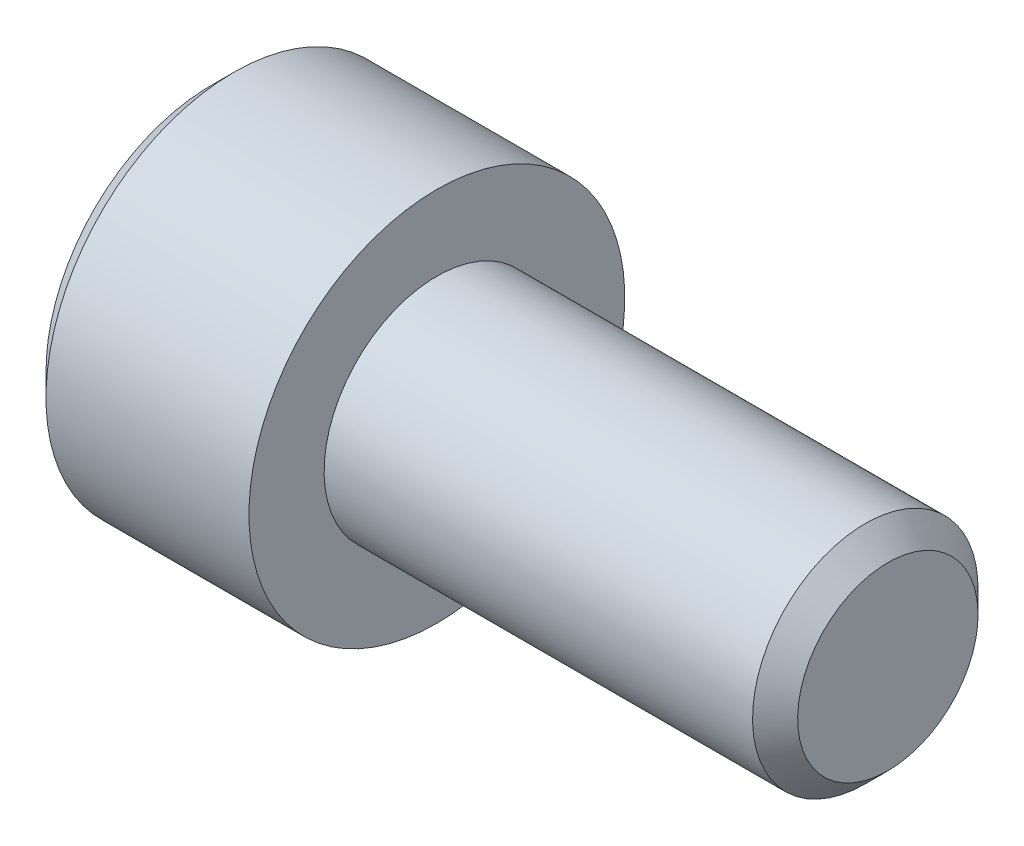
ISO-10303-21;
HEADER;
FILE_DESCRIPTION(('STEP AP214'),'2;1');
FILE_NAME('part.step','',(''),(''),'','','');
FILE_SCHEMA(('AUTOMOTIVE_DESIGN { 1 0 10303 214 1 1 1 1 }'));
ENDSEC;
DATA;
#1=APPLICATION_CONTEXT('core data for automotive mechanical design processes');
#2=APPLICATION_PROTOCOL_DEFINITION('international standard','automotive_design',2000,#1);
#3=PRODUCT_CONTEXT('',#1,'mechanical');
#4=PRODUCT('Part','Part','',(#3));
#5=PRODUCT_RELATED_PRODUCT_CATEGORY('part','',(#4));
#6=PRODUCT_DEFINITION_FORMATION('','',#4);
#7=PRODUCT_DEFINITION_CONTEXT('part definition',#1,'design');
#8=PRODUCT_DEFINITION('design','',#6,#7);
#9=PRODUCT_DEFINITION_SHAPE('','',#8);
#10=(LENGTH_UNIT() NAMED_UNIT(*) SI_UNIT(.MILLI.,.METRE.));
#11=(NAMED_UNIT(*) PLANE_ANGLE_UNIT() SI_UNIT($,.RADIAN.));
#12=(NAMED_UNIT(*) SI_UNIT($,.STERADIAN.) SOLID_ANGLE_UNIT());
#13=UNCERTAINTY_MEASURE_WITH_UNIT(LENGTH_MEASURE(1.E-05),#10,'distance_accuracy_value','');
#14=(GEOMETRIC_REPRESENTATION_CONTEXT(3) GLOBAL_UNCERTAINTY_ASSIGNED_CONTEXT((#13)) GLOBAL_UNIT_ASSIGNED_CONTEXT((#10,
#11,#12)) REPRESENTATION_CONTEXT('',''));
#15=CARTESIAN_POINT('',(0.,0.,0.));
#16=DIRECTION('',(0.,0.,1.));
#17=DIRECTION('',(1.,0.,0.));
#18=AXIS2_PLACEMENT_3D('',#15,#16,#17);
#19=CARTESIAN_POINT('',(-6.,0.,0.));
#20=DIRECTION('',(1.,0.,0.));
#21=DIRECTION('',(0.,1.,0.));
#22=AXIS2_PLACEMENT_3D('',#19,#20,#21);
#23=PLANE('',#22);
#24=CARTESIAN_POINT('',(-6.,0.,0.));
#25=DIRECTION('',(-1.,0.,0.));
#26=DIRECTION('',(0.,-1.,0.));
#27=AXIS2_PLACEMENT_3D('',#24,#25,#26);
#28=CIRCLE('',#27,4.4);
#29=CARTESIAN_POINT('',(-6.,-4.4,0.));
#30=VERTEX_POINT('',#29);
#31=EDGE_CURVE('E156',#30,#30,#28,.T.);
#32=ORIENTED_EDGE('',*,*,#31,.T.);
#33=EDGE_LOOP('',(#32));
#34=FACE_BOUND('',#33,.T.);
#35=DIRECTION('',(0.,-0.499999999999983,-0.866025403784448));
#36=VECTOR('',#35,1.);
#37=CARTESIAN_POINT('',(-6.,-1.4433756729741,2.5));
#38=LINE('',#37,#36);
#39=CARTESIAN_POINT('',(-6.,-1.4433756729741,2.5));
#40=VERTEX_POINT('',#39);
#41=CARTESIAN_POINT('',(-6.,-2.8867513459481,0.));
#42=VERTEX_POINT('',#41);
#43=EDGE_CURVE('E272',#40,#42,#38,.T.);
#44=ORIENTED_EDGE('',*,*,#43,.T.);
#45=DIRECTION('',(0.,0.499999999999983,-0.866025403784448));
#46=VECTOR('',#45,1.);
#47=CARTESIAN_POINT('',(-6.,-2.8867513459481,0.));
#48=LINE('',#47,#46);
#49=CARTESIAN_POINT('',(-6.,-1.4433756729741,-2.5));
#50=VERTEX_POINT('',#49);
#51=EDGE_CURVE('E274',#42,#50,#48,.T.);
#52=ORIENTED_EDGE('',*,*,#51,.T.);
#53=DIRECTION('',(0.,1.,0.));
#54=VECTOR('',#53,1.);
#55=CARTESIAN_POINT('',(-6.,-1.4433756729741,-2.5));
#56=LINE('',#55,#54);
#57=CARTESIAN_POINT('',(-6.,1.4433756729741,-2.5));
#58=VERTEX_POINT('',#57);
#59=EDGE_CURVE('E276',#50,#58,#56,.T.);
#60=ORIENTED_EDGE('',*,*,#59,.T.);
#61=DIRECTION('',(0.,0.499999999999983,0.866025403784448));
#62=VECTOR('',#61,1.);
#63=CARTESIAN_POINT('',(-6.,1.4433756729741,-2.5));
#64=LINE('',#63,#62);
#65=CARTESIAN_POINT('',(-6.,2.8867513459481,0.));
#66=VERTEX_POINT('',#65);
#67=EDGE_CURVE('E121',#58,#66,#64,.T.);
#68=ORIENTED_EDGE('',*,*,#67,.T.);
#69=DIRECTION('',(0.,-0.499999999999983,0.866025403784448));
#70=VECTOR('',#69,1.);
#71=CARTESIAN_POINT('',(-6.,2.8867513459481,0.));
#72=LINE('',#71,#70);
#73=CARTESIAN_POINT('',(-6.,1.4433756729741,2.5));
#74=VERTEX_POINT('',#73);
#75=EDGE_CURVE('E269',#66,#74,#72,.T.);
#76=ORIENTED_EDGE('',*,*,#75,.T.);
#77=DIRECTION('',(0.,-1.,0.));
#78=VECTOR('',#77,1.);
#79=CARTESIAN_POINT('',(-6.,1.4433756729741,2.5));
#80=LINE('',#79,#78);
#81=EDGE_CURVE('E136',#74,#40,#80,.T.);
#82=ORIENTED_EDGE('',*,*,#81,.T.);
#83=EDGE_LOOP('',(#44,#52,#60,#68,#76,#82));
#84=FACE_BOUND('',#83,.T.);
#85=ADVANCED_FACE('F37',(#34,#84),#23,.F.);
#86=CARTESIAN_POINT('',(-5.4,0.,0.));
#87=DIRECTION('',(1.,0.,0.));
#88=DIRECTION('',(0.,1.,0.));
#89=AXIS2_PLACEMENT_3D('',#86,#87,#88);
#90=CONICAL_SURFACE('',#89,5.,0.785398163397445);
#91=ORIENTED_EDGE('',*,*,#31,.F.);
#92=EDGE_LOOP('',(#91));
#93=FACE_BOUND('',#92,.T.);
#94=CARTESIAN_POINT('',(-5.4,0.,0.));
#95=DIRECTION('',(-1.,0.,0.));
#96=DIRECTION('',(0.,-1.,0.));
#97=AXIS2_PLACEMENT_3D('',#94,#95,#96);
#98=CIRCLE('',#97,5.);
#99=CARTESIAN_POINT('',(-5.4,-5.,0.));
#100=VERTEX_POINT('',#99);
#101=EDGE_CURVE('E153',#100,#100,#98,.T.);
#102=ORIENTED_EDGE('',*,*,#101,.T.);
#103=EDGE_LOOP('',(#102));
#104=FACE_BOUND('',#103,.T.);
#105=ADVANCED_FACE('F176',(#93,#104),#90,.T.);
#106=CARTESIAN_POINT('',(12.,0.,0.));
#107=DIRECTION('',(-1.,0.,0.));
#108=DIRECTION('',(0.,-1.,0.));
#109=AXIS2_PLACEMENT_3D('',#106,#107,#108);
#110=CYLINDRICAL_SURFACE('',#109,5.);
#111=ORIENTED_EDGE('',*,*,#101,.F.);
#112=EDGE_LOOP('',(#111));
#113=FACE_BOUND('',#112,.T.);
#114=CARTESIAN_POINT('',(0.,0.,0.));
#115=DIRECTION('',(-1.,0.,0.));
#116=DIRECTION('',(0.,-1.,0.));
#117=AXIS2_PLACEMENT_3D('',#114,#115,#116);
#118=CIRCLE('',#117,5.);
#119=CARTESIAN_POINT('',(0.,-5.,0.));
#120=VERTEX_POINT('',#119);
#121=EDGE_CURVE('E150',#120,#120,#118,.T.);
#122=ORIENTED_EDGE('',*,*,#121,.T.);
#123=EDGE_LOOP('',(#122));
#124=FACE_BOUND('',#123,.T.);
#125=ADVANCED_FACE('F181',(#113,#124),#110,.T.);
#126=CARTESIAN_POINT('',(0.,5.,0.));
#127=DIRECTION('',(-1.,0.,0.));
#128=DIRECTION('',(0.,-1.,0.));
#129=AXIS2_PLACEMENT_3D('',#126,#127,#128);
#130=PLANE('',#129);
#131=ORIENTED_EDGE('',*,*,#121,.F.);
#132=EDGE_LOOP('',(#131));
#133=FACE_BOUND('',#132,.T.);
#134=CARTESIAN_POINT('',(0.,0.,0.));
#135=DIRECTION('',(-1.,0.,0.));
#136=DIRECTION('',(0.,-1.,0.));
#137=AXIS2_PLACEMENT_3D('',#134,#135,#136);
#138=CIRCLE('',#137,3.);
#139=CARTESIAN_POINT('',(0.,-3.,0.));
#140=VERTEX_POINT('',#139);
#141=EDGE_CURVE('E146',#140,#140,#138,.T.);
#142=ORIENTED_EDGE('',*,*,#141,.T.);
#143=EDGE_LOOP('',(#142));
#144=FACE_BOUND('',#143,.T.);
#145=ADVANCED_FACE('F188',(#133,#144),#130,.F.);
#146=CARTESIAN_POINT('',(12.,0.,0.));
#147=DIRECTION('',(-1.,0.,0.));
#148=DIRECTION('',(0.,-1.,0.));
#149=AXIS2_PLACEMENT_3D('',#146,#147,#148);
#150=CYLINDRICAL_SURFACE('',#149,3.);
#151=CARTESIAN_POINT('',(11.4,0.,0.));
#152=DIRECTION('',(-1.,0.,0.));
#153=DIRECTION('',(0.,-1.,0.));
#154=AXIS2_PLACEMENT_3D('',#151,#152,#153);
#155=CIRCLE('',#154,3.);
#156=CARTESIAN_POINT('',(11.4,-3.,0.));
#157=VERTEX_POINT('',#156);
#158=EDGE_CURVE('E45',#157,#157,#155,.T.);
#159=ORIENTED_EDGE('',*,*,#158,.T.);
#160=EDGE_LOOP('',(#159));
#161=FACE_BOUND('',#160,.T.);
#162=ORIENTED_EDGE('',*,*,#141,.F.);
#163=EDGE_LOOP('',(#162));
#164=FACE_BOUND('',#163,.T.);
#165=ADVANCED_FACE('F161',(#161,#164),#150,.T.);
#166=CARTESIAN_POINT('',(12.,2.99999999999999,0.));
#167=DIRECTION('',(-1.,0.,0.));
#168=DIRECTION('',(0.,-1.,0.));
#169=AXIS2_PLACEMENT_3D('',#166,#167,#168);
#170=PLANE('',#169);
#171=CARTESIAN_POINT('',(12.,0.,0.));
#172=DIRECTION('',(-1.,0.,0.));
#173=DIRECTION('',(0.,-1.,0.));
#174=AXIS2_PLACEMENT_3D('',#171,#172,#173);
#175=CIRCLE('',#174,2.39999999999999);
#176=CARTESIAN_POINT('',(12.,-2.39999999999999,0.));
#177=VERTEX_POINT('',#176);
#178=EDGE_CURVE('E11',#177,#177,#175,.F.);
#179=ORIENTED_EDGE('',*,*,#178,.T.);
#180=EDGE_LOOP('',(#179));
#181=FACE_BOUND('',#180,.T.);
#182=ADVANCED_FACE('F165',(#181),#170,.F.);
#183=CARTESIAN_POINT('',(11.4,0.,0.));
#184=DIRECTION('',(-1.,0.,0.));
#185=DIRECTION('',(0.,-1.,0.));
#186=AXIS2_PLACEMENT_3D('',#183,#184,#185);
#187=CONICAL_SURFACE('',#186,3.,0.78539816339745);
#188=ORIENTED_EDGE('',*,*,#178,.F.);
#189=EDGE_LOOP('',(#188));
#190=FACE_BOUND('',#189,.T.);
#191=ORIENTED_EDGE('',*,*,#158,.F.);
#192=EDGE_LOOP('',(#191));
#193=FACE_BOUND('',#192,.T.);
#194=ADVANCED_FACE('F39',(#190,#193),#187,.T.);
#195=CARTESIAN_POINT('',(-3.,2.8867513459481,0.));
#196=DIRECTION('',(0.,-0.866025403784448,-0.499999999999983));
#197=DIRECTION('',(0.,0.499999999999983,-0.866025403784448));
#198=AXIS2_PLACEMENT_3D('',#195,#196,#197);
#199=PLANE('',#198);
#200=DIRECTION('',(0.,-0.499999999999983,0.866025403784448));
#201=VECTOR('',#200,1.);
#202=CARTESIAN_POINT('',(-3.,2.8867513459481,0.));
#203=LINE('',#202,#201);
#204=CARTESIAN_POINT('',(-3.,2.8867513459481,0.));
#205=VERTEX_POINT('',#204);
#206=CARTESIAN_POINT('',(-3.,2.16506350946112,1.24999999999996));
#207=VERTEX_POINT('',#206);
#208=EDGE_CURVE('E118',#205,#207,#203,.T.);
#209=ORIENTED_EDGE('',*,*,#208,.T.);
#210=CARTESIAN_POINT('',(-3.,1.4433756729741,2.5));
#211=VERTEX_POINT('',#210);
#212=EDGE_CURVE('E110',#207,#211,#203,.T.);
#213=ORIENTED_EDGE('',*,*,#212,.T.);
#214=DIRECTION('',(-1.,0.,0.));
#215=VECTOR('',#214,1.);
#216=CARTESIAN_POINT('',(-3.,1.4433756729741,2.5));
#217=LINE('',#216,#215);
#218=EDGE_CURVE('E115',#211,#74,#217,.T.);
#219=ORIENTED_EDGE('',*,*,#218,.T.);
#220=ORIENTED_EDGE('',*,*,#75,.F.);
#221=DIRECTION('',(-1.,0.,0.));
#222=VECTOR('',#221,1.);
#223=CARTESIAN_POINT('',(-3.,2.8867513459481,0.));
#224=LINE('',#223,#222);
#225=EDGE_CURVE('E253',#205,#66,#224,.T.);
#226=ORIENTED_EDGE('',*,*,#225,.F.);
#227=EDGE_LOOP('',(#209,#213,#219,#220,#226));
#228=FACE_BOUND('',#227,.T.);
#229=ADVANCED_FACE('F112',(#228),#199,.T.);
#230=CARTESIAN_POINT('',(-3.,1.4433756729741,2.5));
#231=DIRECTION('',(0.,0.,-1.));
#232=DIRECTION('',(-1.,0.,0.));
#233=AXIS2_PLACEMENT_3D('',#230,#231,#232);
#234=PLANE('',#233);
#235=DIRECTION('',(0.,-1.,0.));
#236=VECTOR('',#235,1.);
#237=CARTESIAN_POINT('',(-3.,1.4433756729741,2.5));
#238=LINE('',#237,#236);
#239=CARTESIAN_POINT('',(-3.,0.,2.5));
#240=VERTEX_POINT('',#239);
#241=EDGE_CURVE('E124',#211,#240,#238,.T.);
#242=ORIENTED_EDGE('',*,*,#241,.T.);
#243=CARTESIAN_POINT('',(-3.,-1.4433756729741,2.5));
#244=VERTEX_POINT('',#243);
#245=EDGE_CURVE('E131',#240,#244,#238,.T.);
#246=ORIENTED_EDGE('',*,*,#245,.T.);
#247=DIRECTION('',(-1.,0.,0.));
#248=VECTOR('',#247,1.);
#249=CARTESIAN_POINT('',(-3.,-1.4433756729741,2.5));
#250=LINE('',#249,#248);
#251=EDGE_CURVE('E138',#244,#40,#250,.T.);
#252=ORIENTED_EDGE('',*,*,#251,.T.);
#253=ORIENTED_EDGE('',*,*,#81,.F.);
#254=ORIENTED_EDGE('',*,*,#218,.F.);
#255=EDGE_LOOP('',(#242,#246,#252,#253,#254));
#256=FACE_BOUND('',#255,.T.);
#257=ADVANCED_FACE('F134',(#256),#234,.T.);
#258=CARTESIAN_POINT('',(-3.,-1.4433756729741,2.5));
#259=DIRECTION('',(0.,0.866025403784448,-0.499999999999983));
#260=DIRECTION('',(0.,0.499999999999983,0.866025403784448));
#261=AXIS2_PLACEMENT_3D('',#258,#259,#260);
#262=PLANE('',#261);
#263=DIRECTION('',(0.,-0.499999999999983,-0.866025403784448));
#264=VECTOR('',#263,1.);
#265=CARTESIAN_POINT('',(-3.,-1.4433756729741,2.5));
#266=LINE('',#265,#264);
#267=CARTESIAN_POINT('',(-3.,-2.16506350946112,1.24999999999996));
#268=VERTEX_POINT('',#267);
#269=EDGE_CURVE('E260',#244,#268,#266,.T.);
#270=ORIENTED_EDGE('',*,*,#269,.T.);
#271=CARTESIAN_POINT('',(-3.,-2.8867513459481,0.));
#272=VERTEX_POINT('',#271);
#273=EDGE_CURVE('E130',#268,#272,#266,.T.);
#274=ORIENTED_EDGE('',*,*,#273,.T.);
#275=DIRECTION('',(-1.,0.,0.));
#276=VECTOR('',#275,1.);
#277=CARTESIAN_POINT('',(-3.,-2.8867513459481,0.));
#278=LINE('',#277,#276);
#279=EDGE_CURVE('E142',#272,#42,#278,.T.);
#280=ORIENTED_EDGE('',*,*,#279,.T.);
#281=ORIENTED_EDGE('',*,*,#43,.F.);
#282=ORIENTED_EDGE('',*,*,#251,.F.);
#283=EDGE_LOOP('',(#270,#274,#280,#281,#282));
#284=FACE_BOUND('',#283,.T.);
#285=ADVANCED_FACE('F202',(#284),#262,.T.);
#286=CARTESIAN_POINT('',(-3.,-2.8867513459481,0.));
#287=DIRECTION('',(0.,0.866025403784448,0.499999999999983));
#288=DIRECTION('',(0.,-0.499999999999983,0.866025403784448));
#289=AXIS2_PLACEMENT_3D('',#286,#287,#288);
#290=PLANE('',#289);
#291=DIRECTION('',(0.,0.499999999999983,-0.866025403784448));
#292=VECTOR('',#291,1.);
#293=CARTESIAN_POINT('',(-3.,-2.8867513459481,0.));
#294=LINE('',#293,#292);
#295=CARTESIAN_POINT('',(-3.,-2.16506350946112,-1.24999999999996));
#296=VERTEX_POINT('',#295);
#297=EDGE_CURVE('E52',#272,#296,#294,.T.);
#298=ORIENTED_EDGE('',*,*,#297,.T.);
#299=CARTESIAN_POINT('',(-3.,-1.4433756729741,-2.5));
#300=VERTEX_POINT('',#299);
#301=EDGE_CURVE('E265',#296,#300,#294,.T.);
#302=ORIENTED_EDGE('',*,*,#301,.T.);
#303=DIRECTION('',(-1.,0.,0.));
#304=VECTOR('',#303,1.);
#305=CARTESIAN_POINT('',(-3.,-1.4433756729741,-2.5));
#306=LINE('',#305,#304);
#307=EDGE_CURVE('E281',#300,#50,#306,.T.);
#308=ORIENTED_EDGE('',*,*,#307,.T.);
#309=ORIENTED_EDGE('',*,*,#51,.F.);
#310=ORIENTED_EDGE('',*,*,#279,.F.);
#311=EDGE_LOOP('',(#298,#302,#308,#309,#310));
#312=FACE_BOUND('',#311,.T.);
#313=ADVANCED_FACE('F205',(#312),#290,.T.);
#314=CARTESIAN_POINT('',(-3.,-1.4433756729741,-2.5));
#315=DIRECTION('',(0.,0.,1.));
#316=DIRECTION('',(1.,0.,0.));
#317=AXIS2_PLACEMENT_3D('',#314,#315,#316);
#318=PLANE('',#317);
#319=DIRECTION('',(0.,1.,0.));
#320=VECTOR('',#319,1.);
#321=CARTESIAN_POINT('',(-3.,-1.4433756729741,-2.5));
#322=LINE('',#321,#320);
#323=CARTESIAN_POINT('',(-3.,0.,-2.5));
#324=VERTEX_POINT('',#323);
#325=EDGE_CURVE('E247',#300,#324,#322,.T.);
#326=ORIENTED_EDGE('',*,*,#325,.T.);
#327=CARTESIAN_POINT('',(-3.,1.4433756729741,-2.5));
#328=VERTEX_POINT('',#327);
#329=EDGE_CURVE('E240',#324,#328,#322,.T.);
#330=ORIENTED_EDGE('',*,*,#329,.T.);
#331=DIRECTION('',(-1.,0.,0.));
#332=VECTOR('',#331,1.);
#333=CARTESIAN_POINT('',(-3.,1.4433756729741,-2.5));
#334=LINE('',#333,#332);
#335=EDGE_CURVE('E252',#328,#58,#334,.T.);
#336=ORIENTED_EDGE('',*,*,#335,.T.);
#337=ORIENTED_EDGE('',*,*,#59,.F.);
#338=ORIENTED_EDGE('',*,*,#307,.F.);
#339=EDGE_LOOP('',(#326,#330,#336,#337,#338));
#340=FACE_BOUND('',#339,.T.);
#341=ADVANCED_FACE('F209',(#340),#318,.T.);
#342=CARTESIAN_POINT('',(-3.,1.4433756729741,-2.5));
#343=DIRECTION('',(0.,-0.866025403784448,0.499999999999983));
#344=DIRECTION('',(0.,-0.499999999999983,-0.866025403784448));
#345=AXIS2_PLACEMENT_3D('',#342,#343,#344);
#346=PLANE('',#345);
#347=DIRECTION('',(0.,0.499999999999983,0.866025403784448));
#348=VECTOR('',#347,1.);
#349=CARTESIAN_POINT('',(-3.,1.4433756729741,-2.5));
#350=LINE('',#349,#348);
#351=CARTESIAN_POINT('',(-3.,2.16506350946112,-1.24999999999996));
#352=VERTEX_POINT('',#351);
#353=EDGE_CURVE('E239',#328,#352,#350,.T.);
#354=ORIENTED_EDGE('',*,*,#353,.T.);
#355=EDGE_CURVE('E245',#352,#205,#350,.T.);
#356=ORIENTED_EDGE('',*,*,#355,.T.);
#357=ORIENTED_EDGE('',*,*,#225,.T.);
#358=ORIENTED_EDGE('',*,*,#67,.F.);
#359=ORIENTED_EDGE('',*,*,#335,.F.);
#360=EDGE_LOOP('',(#354,#356,#357,#358,#359));
#361=FACE_BOUND('',#360,.T.);
#362=ADVANCED_FACE('F212',(#361),#346,.T.);
#363=CARTESIAN_POINT('',(-3.,1.4433756729741,2.5));
#364=DIRECTION('',(1.,0.,0.));
#365=DIRECTION('',(0.,0.,-1.));
#366=AXIS2_PLACEMENT_3D('',#363,#364,#365);
#367=PLANE('',#366);
#368=CARTESIAN_POINT('',(-3.,0.,0.));
#369=DIRECTION('',(-1.,0.,0.));
#370=DIRECTION('',(0.,0.,1.));
#371=AXIS2_PLACEMENT_3D('',#368,#369,#370);
#372=CIRCLE('',#371,2.5);
#373=EDGE_CURVE('E236',#352,#324,#372,.T.);
#374=ORIENTED_EDGE('',*,*,#373,.F.);
#375=ORIENTED_EDGE('',*,*,#353,.F.);
#376=ORIENTED_EDGE('',*,*,#329,.F.);
#377=EDGE_LOOP('',(#374,#375,#376));
#378=FACE_BOUND('',#377,.T.);
#379=ADVANCED_FACE('F216',(#378),#367,.F.);
#380=EDGE_CURVE('E147',#207,#352,#372,.T.);
#381=ORIENTED_EDGE('',*,*,#380,.F.);
#382=ORIENTED_EDGE('',*,*,#208,.F.);
#383=ORIENTED_EDGE('',*,*,#355,.F.);
#384=EDGE_LOOP('',(#381,#382,#383));
#385=FACE_BOUND('',#384,.T.);
#386=ADVANCED_FACE('F227',(#385),#367,.F.);
#387=EDGE_CURVE('E126',#240,#207,#372,.T.);
#388=ORIENTED_EDGE('',*,*,#387,.F.);
#389=ORIENTED_EDGE('',*,*,#241,.F.);
#390=ORIENTED_EDGE('',*,*,#212,.F.);
#391=EDGE_LOOP('',(#388,#389,#390));
#392=FACE_BOUND('',#391,.T.);
#393=ADVANCED_FACE('F125',(#392),#367,.F.);
#394=EDGE_CURVE('E137',#268,#240,#372,.T.);
#395=ORIENTED_EDGE('',*,*,#394,.F.);
#396=ORIENTED_EDGE('',*,*,#269,.F.);
#397=ORIENTED_EDGE('',*,*,#245,.F.);
#398=EDGE_LOOP('',(#395,#396,#397));
#399=FACE_BOUND('',#398,.T.);
#400=ADVANCED_FACE('F224',(#399),#367,.F.);
#401=EDGE_CURVE('E140',#296,#268,#372,.T.);
#402=ORIENTED_EDGE('',*,*,#401,.F.);
#403=ORIENTED_EDGE('',*,*,#297,.F.);
#404=ORIENTED_EDGE('',*,*,#273,.F.);
#405=EDGE_LOOP('',(#402,#403,#404));
#406=FACE_BOUND('',#405,.T.);
#407=ADVANCED_FACE('F219',(#406),#367,.F.);
#408=EDGE_CURVE('E244',#324,#296,#372,.T.);
#409=ORIENTED_EDGE('',*,*,#408,.F.);
#410=ORIENTED_EDGE('',*,*,#325,.F.);
#411=ORIENTED_EDGE('',*,*,#301,.F.);
#412=EDGE_LOOP('',(#409,#410,#411));
#413=FACE_BOUND('',#412,.T.);
#414=ADVANCED_FACE('F197',(#413),#367,.F.);
#415=CARTESIAN_POINT('',(-2.3301270189222,0.,0.));
#416=DIRECTION('',(-1.,0.,0.));
#417=DIRECTION('',(0.,0.,1.));
#418=AXIS2_PLACEMENT_3D('',#415,#416,#417);
#419=CONICAL_SURFACE('',#418,0.,1.30899693899575);
#420=ORIENTED_EDGE('',*,*,#387,.T.);
#421=ORIENTED_EDGE('',*,*,#380,.T.);
#422=ORIENTED_EDGE('',*,*,#373,.T.);
#423=ORIENTED_EDGE('',*,*,#408,.T.);
#424=ORIENTED_EDGE('',*,*,#401,.T.);
#425=ORIENTED_EDGE('',*,*,#394,.T.);
#426=EDGE_LOOP('',(#420,#421,#422,#423,#424,#425));
#427=FACE_BOUND('',#426,.T.);
#428=CARTESIAN_POINT('',(-2.3301270189222,0.,0.));
#429=VERTEX_POINT('',#428);
#430=VERTEX_LOOP('',#429);
#431=FACE_BOUND('',#430,.T.);
#432=ADVANCED_FACE('F195',(#427,#431),#419,.F.);
#433=CLOSED_SHELL('',(#85,#105,#125,#145,#165,#182,#194,#229,#257,#285,#313,#341,#362,#379,#386,
#393,#400,#407,#414,#432));
#434=MANIFOLD_SOLID_BREP('B2',#433);
#435=ADVANCED_BREP_SHAPE_REPRESENTATION('',(#18,#434),#14);
#436=SHAPE_DEFINITION_REPRESENTATION(#9,#435);
ENDSEC;
END-ISO-10303-21;
